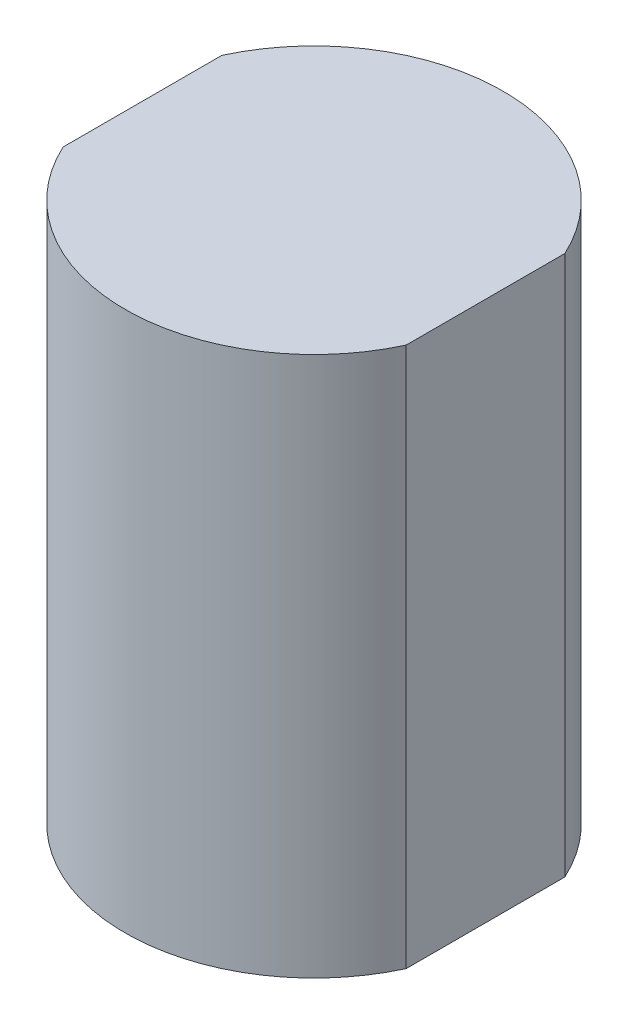
ISO-10303-21;
HEADER;
FILE_DESCRIPTION(('STEP AP214'),'2;1');
FILE_NAME('part.step','',(''),(''),'','','');
FILE_SCHEMA(('AUTOMOTIVE_DESIGN { 1 0 10303 214 1 1 1 1 }'));
ENDSEC;
DATA;
#1=APPLICATION_CONTEXT('core data for automotive mechanical design processes');
#2=APPLICATION_PROTOCOL_DEFINITION('international standard','automotive_design',2000,#1);
#3=PRODUCT_CONTEXT('',#1,'mechanical');
#4=PRODUCT('Part','Part','',(#3));
#5=PRODUCT_RELATED_PRODUCT_CATEGORY('part','',(#4));
#6=PRODUCT_DEFINITION_FORMATION('','',#4);
#7=PRODUCT_DEFINITION_CONTEXT('part definition',#1,'design');
#8=PRODUCT_DEFINITION('design','',#6,#7);
#9=PRODUCT_DEFINITION_SHAPE('','',#8);
#10=(LENGTH_UNIT() NAMED_UNIT(*) SI_UNIT(.MILLI.,.METRE.));
#11=(NAMED_UNIT(*) PLANE_ANGLE_UNIT() SI_UNIT($,.RADIAN.));
#12=(NAMED_UNIT(*) SI_UNIT($,.STERADIAN.) SOLID_ANGLE_UNIT());
#13=UNCERTAINTY_MEASURE_WITH_UNIT(LENGTH_MEASURE(1.E-05),#10,'distance_accuracy_value','');
#14=(GEOMETRIC_REPRESENTATION_CONTEXT(3) GLOBAL_UNCERTAINTY_ASSIGNED_CONTEXT((#13)) GLOBAL_UNIT_ASSIGNED_CONTEXT((#10,
#11,#12)) REPRESENTATION_CONTEXT('',''));
#15=CARTESIAN_POINT('',(0.,0.,0.));
#16=DIRECTION('',(0.,0.,1.));
#17=DIRECTION('',(1.,0.,0.));
#18=AXIS2_PLACEMENT_3D('',#15,#16,#17);
#19=CARTESIAN_POINT('',(3.17633436527076,10.,0.));
#20=DIRECTION('',(-1.,0.,0.));
#21=DIRECTION('',(0.,0.,1.));
#22=AXIS2_PLACEMENT_3D('',#19,#20,#21);
#23=PLANE('',#22);
#24=DIRECTION('',(0.,0.,-1.));
#25=VECTOR('',#24,1.);
#26=CARTESIAN_POINT('',(3.17633436527076,0.,0.));
#27=LINE('',#26,#25);
#28=CARTESIAN_POINT('',(3.17633436527076,0.,1.47));
#29=VERTEX_POINT('',#28);
#30=CARTESIAN_POINT('',(3.17633436527076,0.,-1.47));
#31=VERTEX_POINT('',#30);
#32=EDGE_CURVE('E105',#29,#31,#27,.T.);
#33=ORIENTED_EDGE('',*,*,#32,.T.);
#34=DIRECTION('',(0.,-1.,0.));
#35=VECTOR('',#34,1.);
#36=CARTESIAN_POINT('',(3.17633436527076,10.,-1.47));
#37=LINE('',#36,#35);
#38=CARTESIAN_POINT('',(3.17633436527076,10.,-1.47));
#39=VERTEX_POINT('',#38);
#40=EDGE_CURVE('E11',#39,#31,#37,.T.);
#41=ORIENTED_EDGE('',*,*,#40,.F.);
#42=DIRECTION('',(0.,0.,-1.));
#43=VECTOR('',#42,1.);
#44=CARTESIAN_POINT('',(3.17633436527076,10.,0.));
#45=LINE('',#44,#43);
#46=CARTESIAN_POINT('',(3.17633436527076,10.,1.47));
#47=VERTEX_POINT('',#46);
#48=EDGE_CURVE('E87',#47,#39,#45,.T.);
#49=ORIENTED_EDGE('',*,*,#48,.F.);
#50=DIRECTION('',(0.,-1.,0.));
#51=VECTOR('',#50,1.);
#52=CARTESIAN_POINT('',(3.17633436527076,10.,1.47));
#53=LINE('',#52,#51);
#54=EDGE_CURVE('E102',#47,#29,#53,.T.);
#55=ORIENTED_EDGE('',*,*,#54,.T.);
#56=EDGE_LOOP('',(#33,#41,#49,#55));
#57=FACE_BOUND('',#56,.T.);
#58=ADVANCED_FACE('F39',(#57),#23,.F.);
#59=CARTESIAN_POINT('',(0.,10.,0.));
#60=DIRECTION('',(0.,-1.,0.));
#61=DIRECTION('',(0.,0.,-1.));
#62=AXIS2_PLACEMENT_3D('',#59,#60,#61);
#63=CYLINDRICAL_SURFACE('',#62,3.5);
#64=CARTESIAN_POINT('',(0.,0.,0.));
#65=DIRECTION('',(0.,1.,0.));
#66=DIRECTION('',(0.,0.,1.));
#67=AXIS2_PLACEMENT_3D('',#64,#65,#66);
#68=CIRCLE('',#67,3.5);
#69=CARTESIAN_POINT('',(-3.17633436527076,0.,-1.47));
#70=VERTEX_POINT('',#69);
#71=EDGE_CURVE('E93',#31,#70,#68,.T.);
#72=ORIENTED_EDGE('',*,*,#71,.T.);
#73=DIRECTION('',(0.,-1.,0.));
#74=VECTOR('',#73,1.);
#75=CARTESIAN_POINT('',(-3.17633436527076,10.,-1.47));
#76=LINE('',#75,#74);
#77=CARTESIAN_POINT('',(-3.17633436527076,10.,-1.47));
#78=VERTEX_POINT('',#77);
#79=EDGE_CURVE('E48',#78,#70,#76,.T.);
#80=ORIENTED_EDGE('',*,*,#79,.F.);
#81=CARTESIAN_POINT('',(0.,10.,0.));
#82=DIRECTION('',(0.,1.,0.));
#83=DIRECTION('',(0.,0.,1.));
#84=AXIS2_PLACEMENT_3D('',#81,#82,#83);
#85=CIRCLE('',#84,3.5);
#86=EDGE_CURVE('E82',#39,#78,#85,.T.);
#87=ORIENTED_EDGE('',*,*,#86,.F.);
#88=ORIENTED_EDGE('',*,*,#40,.T.);
#89=EDGE_LOOP('',(#72,#80,#87,#88));
#90=FACE_BOUND('',#89,.T.);
#91=ADVANCED_FACE('F92',(#90),#63,.T.);
#92=CARTESIAN_POINT('',(-3.17633436527076,10.,0.));
#93=DIRECTION('',(-1.,0.,0.));
#94=DIRECTION('',(0.,0.,1.));
#95=AXIS2_PLACEMENT_3D('',#92,#93,#94);
#96=PLANE('',#95);
#97=DIRECTION('',(0.,0.,-1.));
#98=VECTOR('',#97,1.);
#99=CARTESIAN_POINT('',(-3.17633436527076,0.,0.));
#100=LINE('',#99,#98);
#101=CARTESIAN_POINT('',(-3.17633436527076,0.,1.47));
#102=VERTEX_POINT('',#101);
#103=EDGE_CURVE('E111',#102,#70,#100,.T.);
#104=ORIENTED_EDGE('',*,*,#103,.F.);
#105=DIRECTION('',(0.,-1.,0.));
#106=VECTOR('',#105,1.);
#107=CARTESIAN_POINT('',(-3.17633436527076,10.,1.47));
#108=LINE('',#107,#106);
#109=CARTESIAN_POINT('',(-3.17633436527076,10.,1.47));
#110=VERTEX_POINT('',#109);
#111=EDGE_CURVE('E72',#110,#102,#108,.T.);
#112=ORIENTED_EDGE('',*,*,#111,.F.);
#113=DIRECTION('',(0.,0.,-1.));
#114=VECTOR('',#113,1.);
#115=CARTESIAN_POINT('',(-3.17633436527076,10.,0.));
#116=LINE('',#115,#114);
#117=EDGE_CURVE('E85',#110,#78,#116,.T.);
#118=ORIENTED_EDGE('',*,*,#117,.T.);
#119=ORIENTED_EDGE('',*,*,#79,.T.);
#120=EDGE_LOOP('',(#104,#112,#118,#119));
#121=FACE_BOUND('',#120,.T.);
#122=ADVANCED_FACE('F98',(#121),#96,.T.);
#123=EDGE_CURVE('E75',#102,#29,#68,.T.);
#124=ORIENTED_EDGE('',*,*,#123,.T.);
#125=ORIENTED_EDGE('',*,*,#54,.F.);
#126=EDGE_CURVE('E56',#110,#47,#85,.T.);
#127=ORIENTED_EDGE('',*,*,#126,.F.);
#128=ORIENTED_EDGE('',*,*,#111,.T.);
#129=EDGE_LOOP('',(#124,#125,#127,#128));
#130=FACE_BOUND('',#129,.T.);
#131=ADVANCED_FACE('F128',(#130),#63,.T.);
#132=CARTESIAN_POINT('',(0.,10.,0.));
#133=DIRECTION('',(0.,1.,0.));
#134=DIRECTION('',(0.,0.,1.));
#135=AXIS2_PLACEMENT_3D('',#132,#133,#134);
#136=PLANE('',#135);
#137=ORIENTED_EDGE('',*,*,#48,.T.);
#138=ORIENTED_EDGE('',*,*,#86,.T.);
#139=ORIENTED_EDGE('',*,*,#117,.F.);
#140=ORIENTED_EDGE('',*,*,#126,.T.);
#141=EDGE_LOOP('',(#137,#138,#139,#140));
#142=FACE_BOUND('',#141,.T.);
#143=ADVANCED_FACE('F83',(#142),#136,.T.);
#144=CARTESIAN_POINT('',(0.,0.,0.));
#145=DIRECTION('',(0.,1.,0.));
#146=DIRECTION('',(0.,0.,1.));
#147=AXIS2_PLACEMENT_3D('',#144,#145,#146);
#148=PLANE('',#147);
#149=ORIENTED_EDGE('',*,*,#32,.F.);
#150=ORIENTED_EDGE('',*,*,#123,.F.);
#151=ORIENTED_EDGE('',*,*,#103,.T.);
#152=ORIENTED_EDGE('',*,*,#71,.F.);
#153=EDGE_LOOP('',(#149,#150,#151,#152));
#154=FACE_BOUND('',#153,.T.);
#155=ADVANCED_FACE('F120',(#154),#148,.F.);
#156=CLOSED_SHELL('',(#58,#91,#122,#131,#143,#155));
#157=MANIFOLD_SOLID_BREP('B2',#156);
#158=ADVANCED_BREP_SHAPE_REPRESENTATION('',(#18,#157),#14);
#159=SHAPE_DEFINITION_REPRESENTATION(#9,#158);
ENDSEC;
END-ISO-10303-21;
